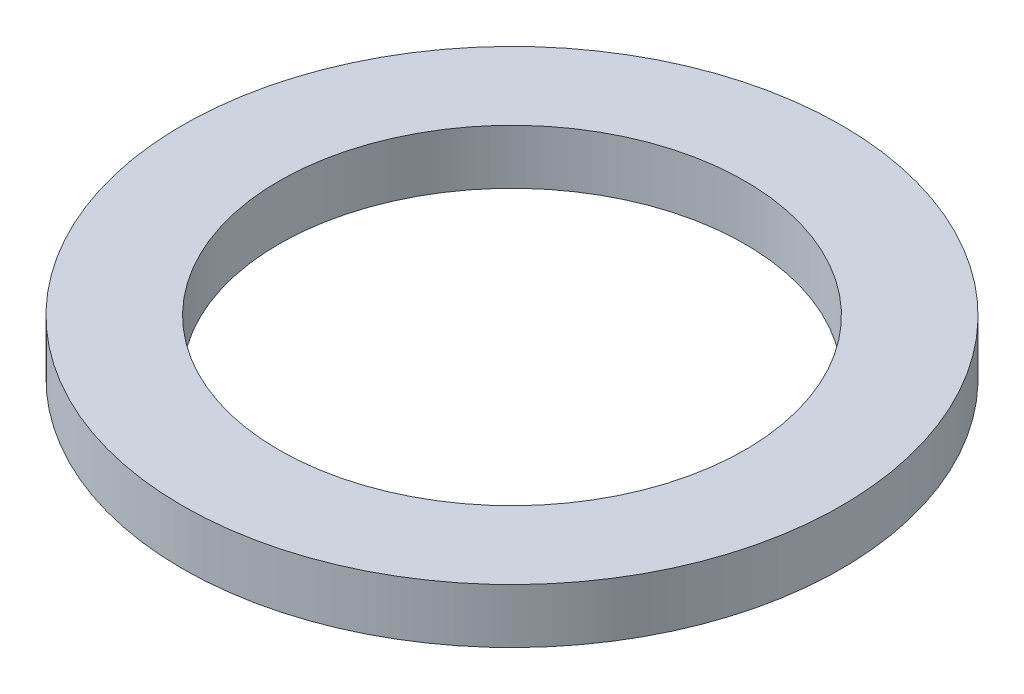
ISO-10303-21;
HEADER;
FILE_DESCRIPTION(('STEP AP214'),'2;1');
FILE_NAME('part.step','',(''),(''),'','','');
FILE_SCHEMA(('AUTOMOTIVE_DESIGN { 1 0 10303 214 1 1 1 1 }'));
ENDSEC;
DATA;
#1=APPLICATION_CONTEXT('core data for automotive mechanical design processes');
#2=APPLICATION_PROTOCOL_DEFINITION('international standard','automotive_design',2000,#1);
#3=PRODUCT_CONTEXT('',#1,'mechanical');
#4=PRODUCT('Part','Part','',(#3));
#5=PRODUCT_RELATED_PRODUCT_CATEGORY('part','',(#4));
#6=PRODUCT_DEFINITION_FORMATION('','',#4);
#7=PRODUCT_DEFINITION_CONTEXT('part definition',#1,'design');
#8=PRODUCT_DEFINITION('design','',#6,#7);
#9=PRODUCT_DEFINITION_SHAPE('','',#8);
#10=(LENGTH_UNIT() NAMED_UNIT(*) SI_UNIT(.MILLI.,.METRE.));
#11=(NAMED_UNIT(*) PLANE_ANGLE_UNIT() SI_UNIT($,.RADIAN.));
#12=(NAMED_UNIT(*) SI_UNIT($,.STERADIAN.) SOLID_ANGLE_UNIT());
#13=UNCERTAINTY_MEASURE_WITH_UNIT(LENGTH_MEASURE(1.E-05),#10,'distance_accuracy_value','');
#14=(GEOMETRIC_REPRESENTATION_CONTEXT(3) GLOBAL_UNCERTAINTY_ASSIGNED_CONTEXT((#13)) GLOBAL_UNIT_ASSIGNED_CONTEXT((#10,
#11,#12)) REPRESENTATION_CONTEXT('',''));
#15=CARTESIAN_POINT('',(0.,0.,0.));
#16=DIRECTION('',(0.,0.,1.));
#17=DIRECTION('',(1.,0.,0.));
#18=AXIS2_PLACEMENT_3D('',#15,#16,#17);
#19=CARTESIAN_POINT('',(0.,22.7096404931965,0.));
#20=DIRECTION('',(0.,1.,0.));
#21=DIRECTION('',(0.,0.,1.));
#22=AXIS2_PLACEMENT_3D('',#19,#20,#21);
#23=CYLINDRICAL_SURFACE('',#22,27.1145);
#24=CARTESIAN_POINT('',(0.,-6.35,0.));
#25=DIRECTION('',(0.,1.,0.));
#26=DIRECTION('',(0.,0.,1.));
#27=AXIS2_PLACEMENT_3D('',#24,#25,#26);
#28=CIRCLE('',#27,27.1145);
#29=CARTESIAN_POINT('',(0.,-6.35,27.1145));
#30=VERTEX_POINT('',#29);
#31=EDGE_CURVE('E48',#30,#30,#28,.T.);
#32=ORIENTED_EDGE('',*,*,#31,.F.);
#33=EDGE_LOOP('',(#32));
#34=FACE_BOUND('',#33,.T.);
#35=CARTESIAN_POINT('',(0.,0.,0.));
#36=DIRECTION('',(0.,1.,0.));
#37=DIRECTION('',(0.,0.,1.));
#38=AXIS2_PLACEMENT_3D('',#35,#36,#37);
#39=CIRCLE('',#38,27.1145);
#40=CARTESIAN_POINT('',(0.,0.,27.1145));
#41=VERTEX_POINT('',#40);
#42=EDGE_CURVE('E10',#41,#41,#39,.T.);
#43=ORIENTED_EDGE('',*,*,#42,.T.);
#44=EDGE_LOOP('',(#43));
#45=FACE_BOUND('',#44,.T.);
#46=ADVANCED_FACE('F34',(#34,#45),#23,.F.);
#47=CARTESIAN_POINT('',(27.1145,0.,0.));
#48=DIRECTION('',(0.,-1.,0.));
#49=DIRECTION('',(0.,0.,-1.));
#50=AXIS2_PLACEMENT_3D('',#47,#48,#49);
#51=PLANE('',#50);
#52=ORIENTED_EDGE('',*,*,#42,.F.);
#53=EDGE_LOOP('',(#52));
#54=FACE_BOUND('',#53,.T.);
#55=CARTESIAN_POINT('',(0.,0.,0.));
#56=DIRECTION('',(0.,1.,0.));
#57=DIRECTION('',(0.,0.,1.));
#58=AXIS2_PLACEMENT_3D('',#55,#56,#57);
#59=CIRCLE('',#58,38.354);
#60=CARTESIAN_POINT('',(0.,0.,38.354));
#61=VERTEX_POINT('',#60);
#62=EDGE_CURVE('E40',#61,#61,#59,.T.);
#63=ORIENTED_EDGE('',*,*,#62,.T.);
#64=EDGE_LOOP('',(#63));
#65=FACE_BOUND('',#64,.T.);
#66=ADVANCED_FACE('F57',(#54,#65),#51,.F.);
#67=CARTESIAN_POINT('',(0.,22.7096404931965,0.));
#68=DIRECTION('',(0.,1.,0.));
#69=DIRECTION('',(0.,0.,1.));
#70=AXIS2_PLACEMENT_3D('',#67,#68,#69);
#71=CYLINDRICAL_SURFACE('',#70,38.354);
#72=ORIENTED_EDGE('',*,*,#62,.F.);
#73=EDGE_LOOP('',(#72));
#74=FACE_BOUND('',#73,.T.);
#75=CARTESIAN_POINT('',(0.,-6.35,0.));
#76=DIRECTION('',(0.,1.,0.));
#77=DIRECTION('',(0.,0.,1.));
#78=AXIS2_PLACEMENT_3D('',#75,#76,#77);
#79=CIRCLE('',#78,38.354);
#80=CARTESIAN_POINT('',(0.,-6.35,38.354));
#81=VERTEX_POINT('',#80);
#82=EDGE_CURVE('E44',#81,#81,#79,.T.);
#83=ORIENTED_EDGE('',*,*,#82,.T.);
#84=EDGE_LOOP('',(#83));
#85=FACE_BOUND('',#84,.T.);
#86=ADVANCED_FACE('F61',(#74,#85),#71,.T.);
#87=CARTESIAN_POINT('',(27.1145,-6.35,0.));
#88=DIRECTION('',(0.,1.,0.));
#89=DIRECTION('',(0.,0.,1.));
#90=AXIS2_PLACEMENT_3D('',#87,#88,#89);
#91=PLANE('',#90);
#92=ORIENTED_EDGE('',*,*,#82,.F.);
#93=EDGE_LOOP('',(#92));
#94=FACE_BOUND('',#93,.T.);
#95=ORIENTED_EDGE('',*,*,#31,.T.);
#96=EDGE_LOOP('',(#95));
#97=FACE_BOUND('',#96,.T.);
#98=ADVANCED_FACE('F54',(#94,#97),#91,.F.);
#99=CLOSED_SHELL('',(#46,#66,#86,#98));
#100=MANIFOLD_SOLID_BREP('B2',#99);
#101=ADVANCED_BREP_SHAPE_REPRESENTATION('',(#18,#100),#14);
#102=SHAPE_DEFINITION_REPRESENTATION(#9,#101);
ENDSEC;
END-ISO-10303-21;
